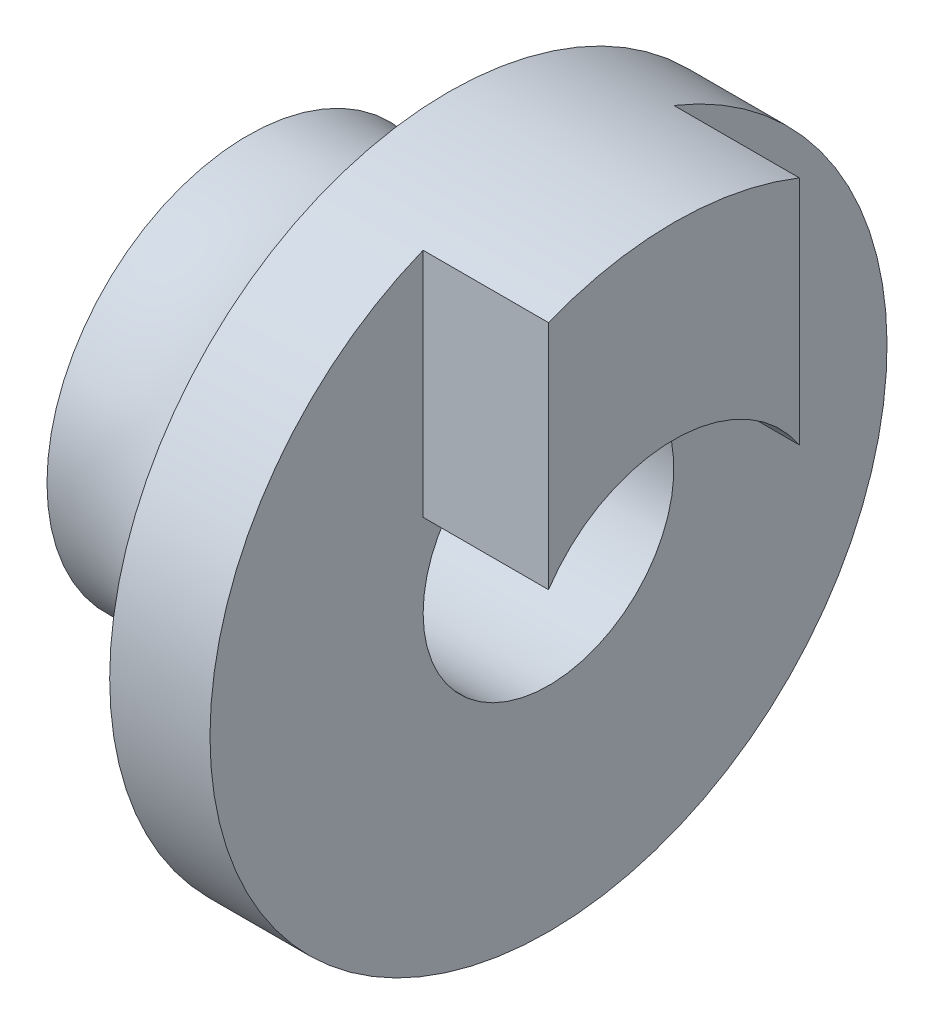
ISO-10303-21;
HEADER;
FILE_DESCRIPTION(('STEP AP214'),'2;1');
FILE_NAME('part.step','',(''),(''),'','','');
FILE_SCHEMA(('AUTOMOTIVE_DESIGN { 1 0 10303 214 1 1 1 1 }'));
ENDSEC;
DATA;
#1=APPLICATION_CONTEXT('core data for automotive mechanical design processes');
#2=APPLICATION_PROTOCOL_DEFINITION('international standard','automotive_design',2000,#1);
#3=PRODUCT_CONTEXT('',#1,'mechanical');
#4=PRODUCT('Part','Part','',(#3));
#5=PRODUCT_RELATED_PRODUCT_CATEGORY('part','',(#4));
#6=PRODUCT_DEFINITION_FORMATION('','',#4);
#7=PRODUCT_DEFINITION_CONTEXT('part definition',#1,'design');
#8=PRODUCT_DEFINITION('design','',#6,#7);
#9=PRODUCT_DEFINITION_SHAPE('','',#8);
#10=(LENGTH_UNIT() NAMED_UNIT(*) SI_UNIT(.MILLI.,.METRE.));
#11=(NAMED_UNIT(*) PLANE_ANGLE_UNIT() SI_UNIT($,.RADIAN.));
#12=(NAMED_UNIT(*) SI_UNIT($,.STERADIAN.) SOLID_ANGLE_UNIT());
#13=UNCERTAINTY_MEASURE_WITH_UNIT(LENGTH_MEASURE(1.E-05),#10,'distance_accuracy_value','');
#14=(GEOMETRIC_REPRESENTATION_CONTEXT(3) GLOBAL_UNCERTAINTY_ASSIGNED_CONTEXT((#13)) GLOBAL_UNIT_ASSIGNED_CONTEXT((#10,
#11,#12)) REPRESENTATION_CONTEXT('',''));
#15=CARTESIAN_POINT('',(0.,0.,0.));
#16=DIRECTION('',(0.,0.,1.));
#17=DIRECTION('',(1.,0.,0.));
#18=AXIS2_PLACEMENT_3D('',#15,#16,#17);
#19=CARTESIAN_POINT('',(0.,13.5,0.));
#20=DIRECTION('',(-1.,0.,0.));
#21=DIRECTION('',(0.,0.,1.));
#22=AXIS2_PLACEMENT_3D('',#19,#20,#21);
#23=PLANE('',#22);
#24=CARTESIAN_POINT('',(0.,0.,0.));
#25=DIRECTION('',(-1.,0.,0.));
#26=DIRECTION('',(0.,0.,1.));
#27=AXIS2_PLACEMENT_3D('',#24,#25,#26);
#28=CIRCLE('',#27,5.);
#29=CARTESIAN_POINT('',(0.,0.,5.));
#30=VERTEX_POINT('',#29);
#31=EDGE_CURVE('E11',#30,#30,#28,.T.);
#32=ORIENTED_EDGE('',*,*,#31,.T.);
#33=EDGE_LOOP('',(#32));
#34=FACE_BOUND('',#33,.T.);
#35=DIRECTION('',(0.,1.,0.));
#36=VECTOR('',#35,1.);
#37=CARTESIAN_POINT('',(0.,12.5399362039845,-5.));
#38=LINE('',#37,#36);
#39=CARTESIAN_POINT('',(0.,3.3166247903554,-5.));
#40=VERTEX_POINT('',#39);
#41=CARTESIAN_POINT('',(0.,12.5399362039845,-5.));
#42=VERTEX_POINT('',#41);
#43=EDGE_CURVE('E44',#40,#42,#38,.T.);
#44=ORIENTED_EDGE('',*,*,#43,.F.);
#45=CARTESIAN_POINT('',(0.,0.,0.));
#46=DIRECTION('',(-1.,0.,0.));
#47=DIRECTION('',(0.,0.,-1.));
#48=AXIS2_PLACEMENT_3D('',#45,#46,#47);
#49=CIRCLE('',#48,6.);
#50=CARTESIAN_POINT('',(0.,3.3166247903554,5.));
#51=VERTEX_POINT('',#50);
#52=EDGE_CURVE('E64',#51,#40,#49,.T.);
#53=ORIENTED_EDGE('',*,*,#52,.F.);
#54=DIRECTION('',(0.,-1.,0.));
#55=VECTOR('',#54,1.);
#56=CARTESIAN_POINT('',(0.,12.5399362039845,5.));
#57=LINE('',#56,#55);
#58=CARTESIAN_POINT('',(0.,12.5399362039845,5.));
#59=VERTEX_POINT('',#58);
#60=EDGE_CURVE('E66',#59,#51,#57,.T.);
#61=ORIENTED_EDGE('',*,*,#60,.F.);
#62=CARTESIAN_POINT('',(0.,0.,0.));
#63=DIRECTION('',(-1.,0.,0.));
#64=DIRECTION('',(0.,0.,1.));
#65=AXIS2_PLACEMENT_3D('',#62,#63,#64);
#66=CIRCLE('',#65,13.5);
#67=EDGE_CURVE('E36',#42,#59,#66,.T.);
#68=ORIENTED_EDGE('',*,*,#67,.F.);
#69=EDGE_LOOP('',(#44,#53,#61,#68));
#70=FACE_BOUND('',#69,.T.);
#71=ADVANCED_FACE('F27',(#34,#70),#23,.F.);
#72=CARTESIAN_POINT('',(-16.0857703102793,0.,0.));
#73=DIRECTION('',(-1.,0.,0.));
#74=DIRECTION('',(0.,0.,1.));
#75=AXIS2_PLACEMENT_3D('',#72,#73,#74);
#76=CYLINDRICAL_SURFACE('',#75,5.);
#77=ORIENTED_EDGE('',*,*,#31,.F.);
#78=EDGE_LOOP('',(#77));
#79=FACE_BOUND('',#78,.T.);
#80=CARTESIAN_POINT('',(-12.,0.,0.));
#81=DIRECTION('',(-1.,0.,0.));
#82=DIRECTION('',(0.,0.,1.));
#83=AXIS2_PLACEMENT_3D('',#80,#81,#82);
#84=CIRCLE('',#83,5.);
#85=CARTESIAN_POINT('',(-12.,0.,5.));
#86=VERTEX_POINT('',#85);
#87=EDGE_CURVE('E85',#86,#86,#84,.T.);
#88=ORIENTED_EDGE('',*,*,#87,.T.);
#89=EDGE_LOOP('',(#88));
#90=FACE_BOUND('',#89,.T.);
#91=ADVANCED_FACE('F29',(#79,#90),#76,.F.);
#92=CARTESIAN_POINT('',(-16.0857703102793,0.,0.));
#93=DIRECTION('',(-1.,0.,0.));
#94=DIRECTION('',(0.,0.,1.));
#95=AXIS2_PLACEMENT_3D('',#92,#93,#94);
#96=CYLINDRICAL_SURFACE('',#95,13.5);
#97=CARTESIAN_POINT('',(-4.,0.,0.));
#98=DIRECTION('',(-1.,0.,0.));
#99=DIRECTION('',(0.,0.,1.));
#100=AXIS2_PLACEMENT_3D('',#97,#98,#99);
#101=CIRCLE('',#100,13.5);
#102=CARTESIAN_POINT('',(-4.,0.,13.5));
#103=VERTEX_POINT('',#102);
#104=EDGE_CURVE('E102',#103,#103,#101,.T.);
#105=ORIENTED_EDGE('',*,*,#104,.F.);
#106=EDGE_LOOP('',(#105));
#107=FACE_BOUND('',#106,.T.);
#108=ORIENTED_EDGE('',*,*,#67,.T.);
#109=DIRECTION('',(-1.,0.,0.));
#110=VECTOR('',#109,1.);
#111=CARTESIAN_POINT('',(5.,12.5399362039845,5.));
#112=LINE('',#111,#110);
#113=CARTESIAN_POINT('',(5.,12.5399362039845,5.));
#114=VERTEX_POINT('',#113);
#115=EDGE_CURVE('E79',#114,#59,#112,.T.);
#116=ORIENTED_EDGE('',*,*,#115,.F.);
#117=CARTESIAN_POINT('',(5.,0.,0.));
#118=DIRECTION('',(1.,0.,0.));
#119=DIRECTION('',(0.,0.,-1.));
#120=AXIS2_PLACEMENT_3D('',#117,#118,#119);
#121=CIRCLE('',#120,13.5);
#122=CARTESIAN_POINT('',(5.,12.5399362039845,-5.));
#123=VERTEX_POINT('',#122);
#124=EDGE_CURVE('E113',#123,#114,#121,.T.);
#125=ORIENTED_EDGE('',*,*,#124,.F.);
#126=DIRECTION('',(-1.,0.,0.));
#127=VECTOR('',#126,1.);
#128=CARTESIAN_POINT('',(5.,12.5399362039845,-5.));
#129=LINE('',#128,#127);
#130=EDGE_CURVE('E87',#123,#42,#129,.T.);
#131=ORIENTED_EDGE('',*,*,#130,.T.);
#132=EDGE_LOOP('',(#108,#116,#125,#131));
#133=FACE_BOUND('',#132,.T.);
#134=ADVANCED_FACE('F127',(#107,#133),#96,.T.);
#135=CARTESIAN_POINT('',(-4.,10.5,0.));
#136=DIRECTION('',(1.,0.,0.));
#137=DIRECTION('',(0.,0.,-1.));
#138=AXIS2_PLACEMENT_3D('',#135,#136,#137);
#139=PLANE('',#138);
#140=CARTESIAN_POINT('',(-4.,0.,0.));
#141=DIRECTION('',(-1.,0.,0.));
#142=DIRECTION('',(0.,0.,1.));
#143=AXIS2_PLACEMENT_3D('',#140,#141,#142);
#144=CIRCLE('',#143,10.5);
#145=CARTESIAN_POINT('',(-4.,0.,10.5));
#146=VERTEX_POINT('',#145);
#147=EDGE_CURVE('E99',#146,#146,#144,.T.);
#148=ORIENTED_EDGE('',*,*,#147,.F.);
#149=EDGE_LOOP('',(#148));
#150=FACE_BOUND('',#149,.T.);
#151=ORIENTED_EDGE('',*,*,#104,.T.);
#152=EDGE_LOOP('',(#151));
#153=FACE_BOUND('',#152,.T.);
#154=ADVANCED_FACE('F149',(#150,#153),#139,.F.);
#155=CARTESIAN_POINT('',(-16.0857703102793,0.,0.));
#156=DIRECTION('',(-1.,0.,0.));
#157=DIRECTION('',(0.,0.,1.));
#158=AXIS2_PLACEMENT_3D('',#155,#156,#157);
#159=CYLINDRICAL_SURFACE('',#158,10.5);
#160=CARTESIAN_POINT('',(-5.,0.,0.));
#161=DIRECTION('',(-1.,0.,0.));
#162=DIRECTION('',(0.,0.,1.));
#163=AXIS2_PLACEMENT_3D('',#160,#161,#162);
#164=CIRCLE('',#163,10.5);
#165=CARTESIAN_POINT('',(-5.,0.,10.5));
#166=VERTEX_POINT('',#165);
#167=EDGE_CURVE('E96',#166,#166,#164,.T.);
#168=ORIENTED_EDGE('',*,*,#167,.F.);
#169=EDGE_LOOP('',(#168));
#170=FACE_BOUND('',#169,.T.);
#171=ORIENTED_EDGE('',*,*,#147,.T.);
#172=EDGE_LOOP('',(#171));
#173=FACE_BOUND('',#172,.T.);
#174=ADVANCED_FACE('F153',(#170,#173),#159,.T.);
#175=CARTESIAN_POINT('',(-10.8827125308196,0.,0.));
#176=DIRECTION('',(-1.,0.,0.));
#177=DIRECTION('',(0.,0.,1.));
#178=AXIS2_PLACEMENT_3D('',#175,#176,#177);
#179=TOROIDAL_SURFACE('',#178,15.921595086295,8.);
#180=CARTESIAN_POINT('',(-12.,0.,0.));
#181=DIRECTION('',(-1.,0.,0.));
#182=DIRECTION('',(0.,0.,1.));
#183=AXIS2_PLACEMENT_3D('',#180,#181,#182);
#184=CIRCLE('',#183,8.);
#185=CARTESIAN_POINT('',(-12.,0.,8.));
#186=VERTEX_POINT('',#185);
#187=EDGE_CURVE('E93',#186,#186,#184,.T.);
#188=ORIENTED_EDGE('',*,*,#187,.F.);
#189=EDGE_LOOP('',(#188));
#190=FACE_BOUND('',#189,.T.);
#191=ORIENTED_EDGE('',*,*,#167,.T.);
#192=EDGE_LOOP('',(#191));
#193=FACE_BOUND('',#192,.T.);
#194=ADVANCED_FACE('F157',(#190,#193),#179,.F.);
#195=CARTESIAN_POINT('',(-12.,5.,0.));
#196=DIRECTION('',(1.,0.,0.));
#197=DIRECTION('',(0.,0.,-1.));
#198=AXIS2_PLACEMENT_3D('',#195,#196,#197);
#199=PLANE('',#198);
#200=ORIENTED_EDGE('',*,*,#87,.F.);
#201=EDGE_LOOP('',(#200));
#202=FACE_BOUND('',#201,.T.);
#203=ORIENTED_EDGE('',*,*,#187,.T.);
#204=EDGE_LOOP('',(#203));
#205=FACE_BOUND('',#204,.T.);
#206=ADVANCED_FACE('F161',(#202,#205),#199,.F.);
#207=CARTESIAN_POINT('',(5.,12.5399362039845,5.));
#208=DIRECTION('',(0.,0.,-1.));
#209=DIRECTION('',(0.,1.,0.));
#210=AXIS2_PLACEMENT_3D('',#207,#208,#209);
#211=PLANE('',#210);
#212=ORIENTED_EDGE('',*,*,#60,.T.);
#213=DIRECTION('',(-1.,0.,0.));
#214=VECTOR('',#213,1.);
#215=CARTESIAN_POINT('',(5.,3.3166247903554,5.));
#216=LINE('',#215,#214);
#217=CARTESIAN_POINT('',(5.,3.3166247903554,5.));
#218=VERTEX_POINT('',#217);
#219=EDGE_CURVE('E76',#218,#51,#216,.T.);
#220=ORIENTED_EDGE('',*,*,#219,.F.);
#221=DIRECTION('',(0.,-1.,0.));
#222=VECTOR('',#221,1.);
#223=CARTESIAN_POINT('',(5.,12.5399362039845,5.));
#224=LINE('',#223,#222);
#225=EDGE_CURVE('E118',#114,#218,#224,.T.);
#226=ORIENTED_EDGE('',*,*,#225,.F.);
#227=ORIENTED_EDGE('',*,*,#115,.T.);
#228=EDGE_LOOP('',(#212,#220,#226,#227));
#229=FACE_BOUND('',#228,.T.);
#230=ADVANCED_FACE('F75',(#229),#211,.F.);
#231=CARTESIAN_POINT('',(5.,0.,0.));
#232=DIRECTION('',(-1.,0.,0.));
#233=DIRECTION('',(0.,0.,1.));
#234=AXIS2_PLACEMENT_3D('',#231,#232,#233);
#235=CYLINDRICAL_SURFACE('',#234,6.);
#236=ORIENTED_EDGE('',*,*,#52,.T.);
#237=DIRECTION('',(-1.,0.,0.));
#238=VECTOR('',#237,1.);
#239=CARTESIAN_POINT('',(5.,3.3166247903554,-5.));
#240=LINE('',#239,#238);
#241=CARTESIAN_POINT('',(5.,3.3166247903554,-5.));
#242=VERTEX_POINT('',#241);
#243=EDGE_CURVE('E83',#242,#40,#240,.T.);
#244=ORIENTED_EDGE('',*,*,#243,.F.);
#245=CARTESIAN_POINT('',(5.,0.,0.));
#246=DIRECTION('',(-1.,0.,0.));
#247=DIRECTION('',(0.,0.,-1.));
#248=AXIS2_PLACEMENT_3D('',#245,#246,#247);
#249=CIRCLE('',#248,6.);
#250=EDGE_CURVE('E82',#218,#242,#249,.T.);
#251=ORIENTED_EDGE('',*,*,#250,.F.);
#252=ORIENTED_EDGE('',*,*,#219,.T.);
#253=EDGE_LOOP('',(#236,#244,#251,#252));
#254=FACE_BOUND('',#253,.T.);
#255=ADVANCED_FACE('F81',(#254),#235,.F.);
#256=CARTESIAN_POINT('',(5.,12.5399362039845,-5.));
#257=DIRECTION('',(0.,0.,1.));
#258=DIRECTION('',(0.,-1.,0.));
#259=AXIS2_PLACEMENT_3D('',#256,#257,#258);
#260=PLANE('',#259);
#261=ORIENTED_EDGE('',*,*,#43,.T.);
#262=ORIENTED_EDGE('',*,*,#130,.F.);
#263=DIRECTION('',(0.,1.,0.));
#264=VECTOR('',#263,1.);
#265=CARTESIAN_POINT('',(5.,12.5399362039845,-5.));
#266=LINE('',#265,#264);
#267=EDGE_CURVE('E120',#242,#123,#266,.T.);
#268=ORIENTED_EDGE('',*,*,#267,.F.);
#269=ORIENTED_EDGE('',*,*,#243,.T.);
#270=EDGE_LOOP('',(#261,#262,#268,#269));
#271=FACE_BOUND('',#270,.T.);
#272=ADVANCED_FACE('F129',(#271),#260,.F.);
#273=CARTESIAN_POINT('',(5.,0.,0.));
#274=DIRECTION('',(1.,0.,0.));
#275=DIRECTION('',(0.,0.,-1.));
#276=AXIS2_PLACEMENT_3D('',#273,#274,#275);
#277=PLANE('',#276);
#278=ORIENTED_EDGE('',*,*,#124,.T.);
#279=ORIENTED_EDGE('',*,*,#225,.T.);
#280=ORIENTED_EDGE('',*,*,#250,.T.);
#281=ORIENTED_EDGE('',*,*,#267,.T.);
#282=EDGE_LOOP('',(#278,#279,#280,#281));
#283=FACE_BOUND('',#282,.T.);
#284=ADVANCED_FACE('F131',(#283),#277,.T.);
#285=CLOSED_SHELL('',(#71,#91,#134,#154,#174,#194,#206,#230,#255,#272,#284));
#286=MANIFOLD_SOLID_BREP('B2',#285);
#287=ADVANCED_BREP_SHAPE_REPRESENTATION('',(#18,#286),#14);
#288=SHAPE_DEFINITION_REPRESENTATION(#9,#287);
ENDSEC;
END-ISO-10303-21;
